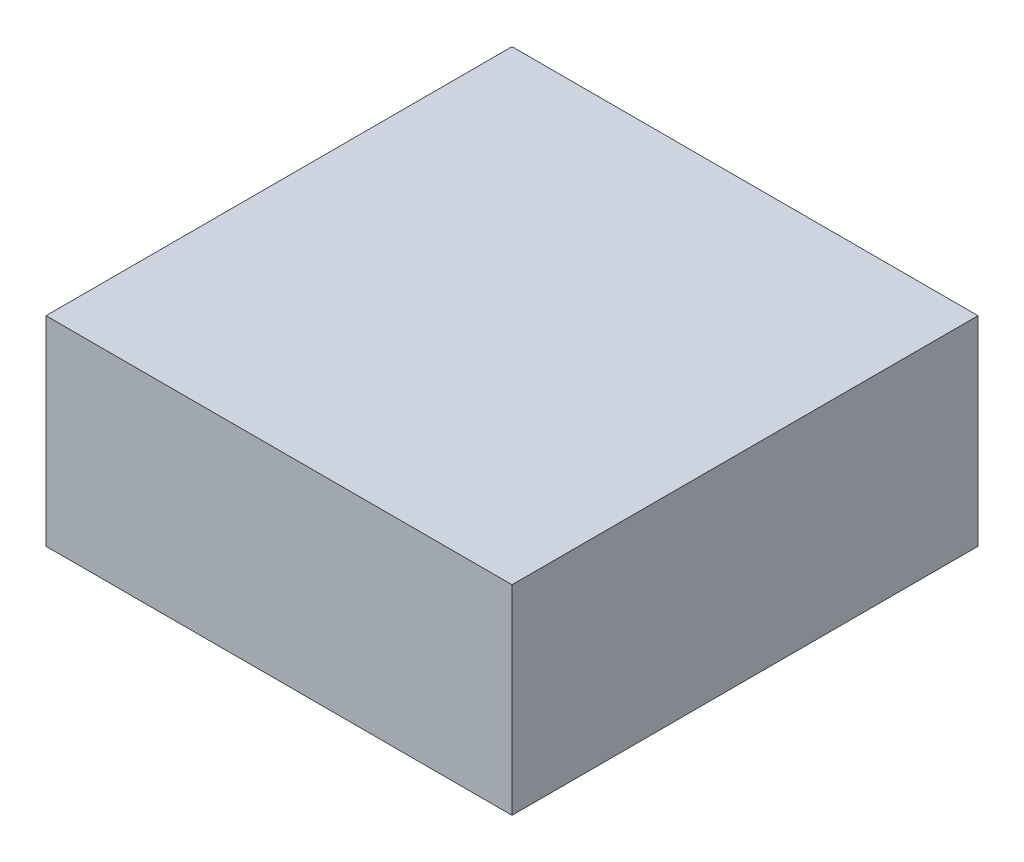
ISO-10303-21;
HEADER;
FILE_DESCRIPTION(('STEP AP214'),'2;1');
FILE_NAME('part.step','',(''),(''),'','','');
FILE_SCHEMA(('AUTOMOTIVE_DESIGN { 1 0 10303 214 1 1 1 1 }'));
ENDSEC;
DATA;
#1=APPLICATION_CONTEXT('core data for automotive mechanical design processes');
#2=APPLICATION_PROTOCOL_DEFINITION('international standard','automotive_design',2000,#1);
#3=PRODUCT_CONTEXT('',#1,'mechanical');
#4=PRODUCT('Part','Part','',(#3));
#5=PRODUCT_RELATED_PRODUCT_CATEGORY('part','',(#4));
#6=PRODUCT_DEFINITION_FORMATION('','',#4);
#7=PRODUCT_DEFINITION_CONTEXT('part definition',#1,'design');
#8=PRODUCT_DEFINITION('design','',#6,#7);
#9=PRODUCT_DEFINITION_SHAPE('','',#8);
#10=(LENGTH_UNIT() NAMED_UNIT(*) SI_UNIT(.MILLI.,.METRE.));
#11=(NAMED_UNIT(*) PLANE_ANGLE_UNIT() SI_UNIT($,.RADIAN.));
#12=(NAMED_UNIT(*) SI_UNIT($,.STERADIAN.) SOLID_ANGLE_UNIT());
#13=UNCERTAINTY_MEASURE_WITH_UNIT(LENGTH_MEASURE(1.E-05),#10,'distance_accuracy_value','');
#14=(GEOMETRIC_REPRESENTATION_CONTEXT(3) GLOBAL_UNCERTAINTY_ASSIGNED_CONTEXT((#13)) GLOBAL_UNIT_ASSIGNED_CONTEXT((#10,
#11,#12)) REPRESENTATION_CONTEXT('',''));
#15=CARTESIAN_POINT('',(0.,0.,0.));
#16=DIRECTION('',(0.,0.,1.));
#17=DIRECTION('',(1.,0.,0.));
#18=AXIS2_PLACEMENT_3D('',#15,#16,#17);
#19=CARTESIAN_POINT('',(0.,38.1,0.));
#20=DIRECTION('',(1.,0.,0.));
#21=DIRECTION('',(0.,0.,-1.));
#22=AXIS2_PLACEMENT_3D('',#19,#20,#21);
#23=PLANE('',#22);
#24=DIRECTION('',(0.,0.,1.));
#25=VECTOR('',#24,1.);
#26=CARTESIAN_POINT('',(0.,0.,0.));
#27=LINE('',#26,#25);
#28=CARTESIAN_POINT('',(0.,0.,-88.9));
#29=VERTEX_POINT('',#28);
#30=CARTESIAN_POINT('',(0.,0.,0.));
#31=VERTEX_POINT('',#30);
#32=EDGE_CURVE('E94',#29,#31,#27,.T.);
#33=ORIENTED_EDGE('',*,*,#32,.T.);
#34=DIRECTION('',(0.,-1.,0.));
#35=VECTOR('',#34,1.);
#36=CARTESIAN_POINT('',(0.,38.1,0.));
#37=LINE('',#36,#35);
#38=CARTESIAN_POINT('',(0.,38.1,0.));
#39=VERTEX_POINT('',#38);
#40=EDGE_CURVE('E11',#39,#31,#37,.T.);
#41=ORIENTED_EDGE('',*,*,#40,.F.);
#42=DIRECTION('',(0.,0.,1.));
#43=VECTOR('',#42,1.);
#44=CARTESIAN_POINT('',(0.,38.1,0.));
#45=LINE('',#44,#43);
#46=CARTESIAN_POINT('',(0.,38.1,-88.9));
#47=VERTEX_POINT('',#46);
#48=EDGE_CURVE('E82',#47,#39,#45,.T.);
#49=ORIENTED_EDGE('',*,*,#48,.F.);
#50=DIRECTION('',(0.,-1.,0.));
#51=VECTOR('',#50,1.);
#52=CARTESIAN_POINT('',(0.,38.1,-88.9));
#53=LINE('',#52,#51);
#54=EDGE_CURVE('E90',#47,#29,#53,.T.);
#55=ORIENTED_EDGE('',*,*,#54,.T.);
#56=EDGE_LOOP('',(#33,#41,#49,#55));
#57=FACE_BOUND('',#56,.T.);
#58=ADVANCED_FACE('F31',(#57),#23,.F.);
#59=CARTESIAN_POINT('',(0.,38.1,0.));
#60=DIRECTION('',(0.,0.,-1.));
#61=DIRECTION('',(-1.,0.,0.));
#62=AXIS2_PLACEMENT_3D('',#59,#60,#61);
#63=PLANE('',#62);
#64=DIRECTION('',(1.,0.,0.));
#65=VECTOR('',#64,1.);
#66=CARTESIAN_POINT('',(0.,0.,0.));
#67=LINE('',#66,#65);
#68=CARTESIAN_POINT('',(88.9,0.,0.));
#69=VERTEX_POINT('',#68);
#70=EDGE_CURVE('E86',#31,#69,#67,.T.);
#71=ORIENTED_EDGE('',*,*,#70,.T.);
#72=DIRECTION('',(0.,-1.,0.));
#73=VECTOR('',#72,1.);
#74=CARTESIAN_POINT('',(88.9,38.1,0.));
#75=LINE('',#74,#73);
#76=CARTESIAN_POINT('',(88.9,38.1,0.));
#77=VERTEX_POINT('',#76);
#78=EDGE_CURVE('E39',#77,#69,#75,.T.);
#79=ORIENTED_EDGE('',*,*,#78,.F.);
#80=DIRECTION('',(1.,0.,0.));
#81=VECTOR('',#80,1.);
#82=CARTESIAN_POINT('',(0.,38.1,0.));
#83=LINE('',#82,#81);
#84=EDGE_CURVE('E77',#39,#77,#83,.T.);
#85=ORIENTED_EDGE('',*,*,#84,.F.);
#86=ORIENTED_EDGE('',*,*,#40,.T.);
#87=EDGE_LOOP('',(#71,#79,#85,#86));
#88=FACE_BOUND('',#87,.T.);
#89=ADVANCED_FACE('F85',(#88),#63,.F.);
#90=CARTESIAN_POINT('',(88.9,38.1,0.));
#91=DIRECTION('',(-1.,0.,0.));
#92=DIRECTION('',(0.,0.,1.));
#93=AXIS2_PLACEMENT_3D('',#90,#91,#92);
#94=PLANE('',#93);
#95=DIRECTION('',(0.,0.,-1.));
#96=VECTOR('',#95,1.);
#97=CARTESIAN_POINT('',(88.9,0.,0.));
#98=LINE('',#97,#96);
#99=CARTESIAN_POINT('',(88.9,0.,-88.9));
#100=VERTEX_POINT('',#99);
#101=EDGE_CURVE('E64',#69,#100,#98,.T.);
#102=ORIENTED_EDGE('',*,*,#101,.T.);
#103=DIRECTION('',(0.,-1.,0.));
#104=VECTOR('',#103,1.);
#105=CARTESIAN_POINT('',(88.9,38.1,-88.9));
#106=LINE('',#105,#104);
#107=CARTESIAN_POINT('',(88.9,38.1,-88.9));
#108=VERTEX_POINT('',#107);
#109=EDGE_CURVE('E87',#108,#100,#106,.T.);
#110=ORIENTED_EDGE('',*,*,#109,.F.);
#111=DIRECTION('',(0.,0.,-1.));
#112=VECTOR('',#111,1.);
#113=CARTESIAN_POINT('',(88.9,38.1,0.));
#114=LINE('',#113,#112);
#115=EDGE_CURVE('E80',#77,#108,#114,.T.);
#116=ORIENTED_EDGE('',*,*,#115,.F.);
#117=ORIENTED_EDGE('',*,*,#78,.T.);
#118=EDGE_LOOP('',(#102,#110,#116,#117));
#119=FACE_BOUND('',#118,.T.);
#120=ADVANCED_FACE('F88',(#119),#94,.F.);
#121=CARTESIAN_POINT('',(0.,38.1,-88.9));
#122=DIRECTION('',(0.,0.,1.));
#123=DIRECTION('',(1.,0.,0.));
#124=AXIS2_PLACEMENT_3D('',#121,#122,#123);
#125=PLANE('',#124);
#126=DIRECTION('',(-1.,0.,0.));
#127=VECTOR('',#126,1.);
#128=CARTESIAN_POINT('',(0.,0.,-88.9));
#129=LINE('',#128,#127);
#130=EDGE_CURVE('E70',#100,#29,#129,.T.);
#131=ORIENTED_EDGE('',*,*,#130,.T.);
#132=ORIENTED_EDGE('',*,*,#54,.F.);
#133=DIRECTION('',(-1.,0.,0.));
#134=VECTOR('',#133,1.);
#135=CARTESIAN_POINT('',(0.,38.1,-88.9));
#136=LINE('',#135,#134);
#137=EDGE_CURVE('E47',#108,#47,#136,.T.);
#138=ORIENTED_EDGE('',*,*,#137,.F.);
#139=ORIENTED_EDGE('',*,*,#109,.T.);
#140=EDGE_LOOP('',(#131,#132,#138,#139));
#141=FACE_BOUND('',#140,.T.);
#142=ADVANCED_FACE('F101',(#141),#125,.F.);
#143=CARTESIAN_POINT('',(0.,38.1,-88.9));
#144=DIRECTION('',(0.,-1.,0.));
#145=DIRECTION('',(0.,0.,-1.));
#146=AXIS2_PLACEMENT_3D('',#143,#144,#145);
#147=PLANE('',#146);
#148=ORIENTED_EDGE('',*,*,#48,.T.);
#149=ORIENTED_EDGE('',*,*,#84,.T.);
#150=ORIENTED_EDGE('',*,*,#115,.T.);
#151=ORIENTED_EDGE('',*,*,#137,.T.);
#152=EDGE_LOOP('',(#148,#149,#150,#151));
#153=FACE_BOUND('',#152,.T.);
#154=ADVANCED_FACE('F78',(#153),#147,.F.);
#155=CARTESIAN_POINT('',(0.,0.,-88.9));
#156=DIRECTION('',(0.,-1.,0.));
#157=DIRECTION('',(0.,0.,-1.));
#158=AXIS2_PLACEMENT_3D('',#155,#156,#157);
#159=PLANE('',#158);
#160=ORIENTED_EDGE('',*,*,#32,.F.);
#161=ORIENTED_EDGE('',*,*,#130,.F.);
#162=ORIENTED_EDGE('',*,*,#101,.F.);
#163=ORIENTED_EDGE('',*,*,#70,.F.);
#164=EDGE_LOOP('',(#160,#161,#162,#163));
#165=FACE_BOUND('',#164,.T.);
#166=ADVANCED_FACE('F104',(#165),#159,.T.);
#167=CLOSED_SHELL('',(#58,#89,#120,#142,#154,#166));
#168=MANIFOLD_SOLID_BREP('B2',#167);
#169=ADVANCED_BREP_SHAPE_REPRESENTATION('',(#18,#168),#14);
#170=SHAPE_DEFINITION_REPRESENTATION(#9,#169);
ENDSEC;
END-ISO-10303-21;
